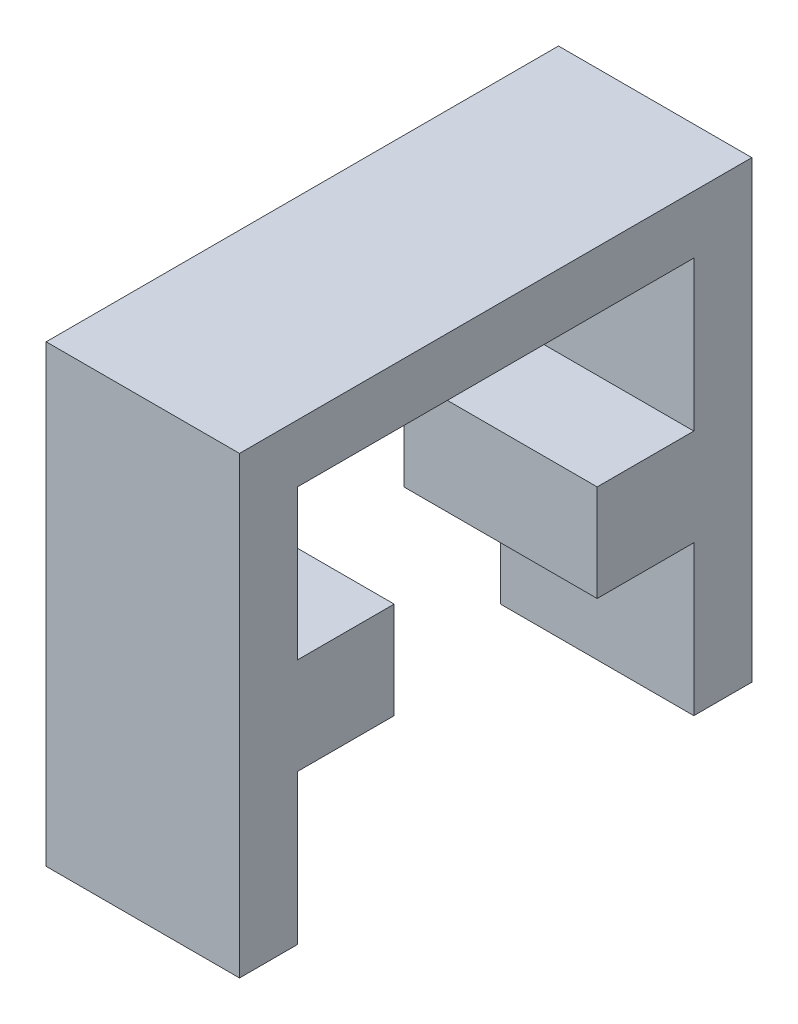
ISO-10303-21;
HEADER;
FILE_DESCRIPTION(('STEP AP214'),'2;1');
FILE_NAME('part.step','',(''),(''),'','','');
FILE_SCHEMA(('AUTOMOTIVE_DESIGN { 1 0 10303 214 1 1 1 1 }'));
ENDSEC;
DATA;
#1=APPLICATION_CONTEXT('core data for automotive mechanical design processes');
#2=APPLICATION_PROTOCOL_DEFINITION('international standard','automotive_design',2000,#1);
#3=PRODUCT_CONTEXT('',#1,'mechanical');
#4=PRODUCT('Part','Part','',(#3));
#5=PRODUCT_RELATED_PRODUCT_CATEGORY('part','',(#4));
#6=PRODUCT_DEFINITION_FORMATION('','',#4);
#7=PRODUCT_DEFINITION_CONTEXT('part definition',#1,'design');
#8=PRODUCT_DEFINITION('design','',#6,#7);
#9=PRODUCT_DEFINITION_SHAPE('','',#8);
#10=(LENGTH_UNIT() NAMED_UNIT(*) SI_UNIT(.MILLI.,.METRE.));
#11=(NAMED_UNIT(*) PLANE_ANGLE_UNIT() SI_UNIT($,.RADIAN.));
#12=(NAMED_UNIT(*) SI_UNIT($,.STERADIAN.) SOLID_ANGLE_UNIT());
#13=UNCERTAINTY_MEASURE_WITH_UNIT(LENGTH_MEASURE(1.E-05),#10,'distance_accuracy_value','');
#14=(GEOMETRIC_REPRESENTATION_CONTEXT(3) GLOBAL_UNCERTAINTY_ASSIGNED_CONTEXT((#13)) GLOBAL_UNIT_ASSIGNED_CONTEXT((#10,
#11,#12)) REPRESENTATION_CONTEXT('',''));
#15=CARTESIAN_POINT('',(0.,0.,0.));
#16=DIRECTION('',(0.,0.,1.));
#17=DIRECTION('',(1.,0.,0.));
#18=AXIS2_PLACEMENT_3D('',#15,#16,#17);
#19=CARTESIAN_POINT('',(10.,0.,0.));
#20=DIRECTION('',(1.,0.,0.));
#21=DIRECTION('',(0.,0.,-1.));
#22=AXIS2_PLACEMENT_3D('',#19,#20,#21);
#23=PLANE('',#22);
#24=DIRECTION('',(0.,1.,0.));
#25=VECTOR('',#24,1.);
#26=CARTESIAN_POINT('',(10.,0.,-26.5));
#27=LINE('',#26,#25);
#28=CARTESIAN_POINT('',(10.,-23.5,-26.5));
#29=VERTEX_POINT('',#28);
#30=CARTESIAN_POINT('',(9.99999999999999,0.,-26.5));
#31=VERTEX_POINT('',#30);
#32=EDGE_CURVE('E172',#29,#31,#27,.T.);
#33=ORIENTED_EDGE('',*,*,#32,.T.);
#34=DIRECTION('',(0.,0.,1.));
#35=VECTOR('',#34,1.);
#36=CARTESIAN_POINT('',(10.,0.,-37.642135623731));
#37=LINE('',#36,#35);
#38=CARTESIAN_POINT('',(10.,0.,0.));
#39=VERTEX_POINT('',#38);
#40=EDGE_CURVE('E169',#31,#39,#37,.T.);
#41=ORIENTED_EDGE('',*,*,#40,.T.);
#42=DIRECTION('',(0.,-1.,0.));
#43=VECTOR('',#42,1.);
#44=CARTESIAN_POINT('',(10.,0.,0.));
#45=LINE('',#44,#43);
#46=CARTESIAN_POINT('',(10.,-23.5,0.));
#47=VERTEX_POINT('',#46);
#48=EDGE_CURVE('E158',#39,#47,#45,.T.);
#49=ORIENTED_EDGE('',*,*,#48,.T.);
#50=DIRECTION('',(0.,0.,-1.));
#51=VECTOR('',#50,1.);
#52=CARTESIAN_POINT('',(10.,-23.5,0.));
#53=LINE('',#52,#51);
#54=CARTESIAN_POINT('',(10.,-23.5,-3.));
#55=VERTEX_POINT('',#54);
#56=EDGE_CURVE('E222',#47,#55,#53,.T.);
#57=ORIENTED_EDGE('',*,*,#56,.T.);
#58=DIRECTION('',(0.,1.,0.));
#59=VECTOR('',#58,1.);
#60=CARTESIAN_POINT('',(10.,-23.5,-3.));
#61=LINE('',#60,#59);
#62=CARTESIAN_POINT('',(10.,-15.75,-3.));
#63=VERTEX_POINT('',#62);
#64=EDGE_CURVE('E225',#55,#63,#61,.T.);
#65=ORIENTED_EDGE('',*,*,#64,.T.);
#66=DIRECTION('',(0.,0.,-1.));
#67=VECTOR('',#66,1.);
#68=CARTESIAN_POINT('',(10.,-15.75,-3.));
#69=LINE('',#68,#67);
#70=CARTESIAN_POINT('',(10.,-15.75,-8.));
#71=VERTEX_POINT('',#70);
#72=EDGE_CURVE('E197',#63,#71,#69,.T.);
#73=ORIENTED_EDGE('',*,*,#72,.T.);
#74=DIRECTION('',(0.,1.,0.));
#75=VECTOR('',#74,1.);
#76=CARTESIAN_POINT('',(10.,-10.75,-8.));
#77=LINE('',#76,#75);
#78=CARTESIAN_POINT('',(10.,-10.75,-8.));
#79=VERTEX_POINT('',#78);
#80=EDGE_CURVE('E206',#71,#79,#77,.T.);
#81=ORIENTED_EDGE('',*,*,#80,.T.);
#82=DIRECTION('',(0.,0.,1.));
#83=VECTOR('',#82,1.);
#84=CARTESIAN_POINT('',(10.,-10.75,-3.));
#85=LINE('',#84,#83);
#86=CARTESIAN_POINT('',(10.,-10.75,-3.00000000000001));
#87=VERTEX_POINT('',#86);
#88=EDGE_CURVE('E55',#79,#87,#85,.T.);
#89=ORIENTED_EDGE('',*,*,#88,.T.);
#90=CARTESIAN_POINT('',(10.,-3.,-3.00000000000001));
#91=VERTEX_POINT('',#90);
#92=EDGE_CURVE('E224',#87,#91,#61,.T.);
#93=ORIENTED_EDGE('',*,*,#92,.T.);
#94=DIRECTION('',(0.,0.,-1.));
#95=VECTOR('',#94,1.);
#96=CARTESIAN_POINT('',(10.,-3.,-3.00000000000001));
#97=LINE('',#96,#95);
#98=CARTESIAN_POINT('',(10.,-3.,-23.5));
#99=VERTEX_POINT('',#98);
#100=EDGE_CURVE('E228',#91,#99,#97,.T.);
#101=ORIENTED_EDGE('',*,*,#100,.T.);
#102=DIRECTION('',(0.,-1.,0.));
#103=VECTOR('',#102,1.);
#104=CARTESIAN_POINT('',(10.,-3.,-23.5));
#105=LINE('',#104,#103);
#106=CARTESIAN_POINT('',(10.,-10.75,-23.5));
#107=VERTEX_POINT('',#106);
#108=EDGE_CURVE('E231',#99,#107,#105,.T.);
#109=ORIENTED_EDGE('',*,*,#108,.T.);
#110=DIRECTION('',(0.,0.,1.));
#111=VECTOR('',#110,1.);
#112=CARTESIAN_POINT('',(10.,-10.75,-23.5));
#113=LINE('',#112,#111);
#114=CARTESIAN_POINT('',(10.,-10.75,-18.5));
#115=VERTEX_POINT('',#114);
#116=EDGE_CURVE('E174',#107,#115,#113,.T.);
#117=ORIENTED_EDGE('',*,*,#116,.T.);
#118=DIRECTION('',(0.,-1.,0.));
#119=VECTOR('',#118,1.);
#120=CARTESIAN_POINT('',(10.,-10.75,-18.5));
#121=LINE('',#120,#119);
#122=CARTESIAN_POINT('',(10.,-15.75,-18.5));
#123=VERTEX_POINT('',#122);
#124=EDGE_CURVE('E185',#115,#123,#121,.T.);
#125=ORIENTED_EDGE('',*,*,#124,.T.);
#126=DIRECTION('',(0.,0.,-1.));
#127=VECTOR('',#126,1.);
#128=CARTESIAN_POINT('',(10.,-15.75,-23.5));
#129=LINE('',#128,#127);
#130=CARTESIAN_POINT('',(10.,-15.75,-23.5));
#131=VERTEX_POINT('',#130);
#132=EDGE_CURVE('E48',#123,#131,#129,.T.);
#133=ORIENTED_EDGE('',*,*,#132,.T.);
#134=CARTESIAN_POINT('',(10.,-23.5,-23.5));
#135=VERTEX_POINT('',#134);
#136=EDGE_CURVE('E230',#131,#135,#105,.T.);
#137=ORIENTED_EDGE('',*,*,#136,.T.);
#138=DIRECTION('',(0.,0.,-1.));
#139=VECTOR('',#138,1.);
#140=CARTESIAN_POINT('',(10.,-23.5,-23.5));
#141=LINE('',#140,#139);
#142=EDGE_CURVE('E234',#135,#29,#141,.T.);
#143=ORIENTED_EDGE('',*,*,#142,.T.);
#144=EDGE_LOOP('',(#33,#41,#49,#57,#65,#73,#81,#89,#93,#101,#109,#117,#125,#133,#137,#143));
#145=FACE_BOUND('',#144,.T.);
#146=ADVANCED_FACE('F33',(#145),#23,.T.);
#147=CARTESIAN_POINT('',(10.,-3.,-23.5));
#148=DIRECTION('',(0.,0.,-1.));
#149=DIRECTION('',(0.,1.,0.));
#150=AXIS2_PLACEMENT_3D('',#147,#148,#149);
#151=PLANE('',#150);
#152=ORIENTED_EDGE('',*,*,#136,.F.);
#153=DIRECTION('',(1.,0.,0.));
#154=VECTOR('',#153,1.);
#155=CARTESIAN_POINT('',(-7.07106781186548,-15.75,-23.5));
#156=LINE('',#155,#154);
#157=CARTESIAN_POINT('',(0.,-15.75,-23.5));
#158=VERTEX_POINT('',#157);
#159=EDGE_CURVE('E180',#158,#131,#156,.T.);
#160=ORIENTED_EDGE('',*,*,#159,.F.);
#161=DIRECTION('',(0.,-1.,0.));
#162=VECTOR('',#161,1.);
#163=CARTESIAN_POINT('',(0.,-3.,-23.5));
#164=LINE('',#163,#162);
#165=CARTESIAN_POINT('',(0.,-23.5,-23.5));
#166=VERTEX_POINT('',#165);
#167=EDGE_CURVE('E246',#158,#166,#164,.T.);
#168=ORIENTED_EDGE('',*,*,#167,.T.);
#169=DIRECTION('',(-1.,0.,0.));
#170=VECTOR('',#169,1.);
#171=CARTESIAN_POINT('',(10.,-23.5,-23.5));
#172=LINE('',#171,#170);
#173=EDGE_CURVE('E252',#135,#166,#172,.T.);
#174=ORIENTED_EDGE('',*,*,#173,.F.);
#175=EDGE_LOOP('',(#152,#160,#168,#174));
#176=FACE_BOUND('',#175,.T.);
#177=ADVANCED_FACE('F286',(#176),#151,.F.);
#178=CARTESIAN_POINT('',(10.,-23.5,-3.));
#179=DIRECTION('',(0.,0.,1.));
#180=DIRECTION('',(0.,-1.,0.));
#181=AXIS2_PLACEMENT_3D('',#178,#179,#180);
#182=PLANE('',#181);
#183=ORIENTED_EDGE('',*,*,#92,.F.);
#184=DIRECTION('',(1.,0.,0.));
#185=VECTOR('',#184,1.);
#186=CARTESIAN_POINT('',(-7.07106781186548,-10.75,-3.));
#187=LINE('',#186,#185);
#188=CARTESIAN_POINT('',(0.,-10.75,-3.));
#189=VERTEX_POINT('',#188);
#190=EDGE_CURVE('E201',#189,#87,#187,.T.);
#191=ORIENTED_EDGE('',*,*,#190,.F.);
#192=DIRECTION('',(0.,1.,0.));
#193=VECTOR('',#192,1.);
#194=CARTESIAN_POINT('',(0.,-23.5,-3.));
#195=LINE('',#194,#193);
#196=CARTESIAN_POINT('',(0.,-3.,-3.00000000000001));
#197=VERTEX_POINT('',#196);
#198=EDGE_CURVE('E240',#189,#197,#195,.T.);
#199=ORIENTED_EDGE('',*,*,#198,.T.);
#200=DIRECTION('',(-1.,0.,0.));
#201=VECTOR('',#200,1.);
#202=CARTESIAN_POINT('',(10.,-3.,-3.00000000000001));
#203=LINE('',#202,#201);
#204=EDGE_CURVE('E258',#91,#197,#203,.T.);
#205=ORIENTED_EDGE('',*,*,#204,.F.);
#206=EDGE_LOOP('',(#183,#191,#199,#205));
#207=FACE_BOUND('',#206,.T.);
#208=ADVANCED_FACE('F283',(#207),#182,.F.);
#209=CARTESIAN_POINT('',(0.,0.,0.));
#210=DIRECTION('',(1.,0.,0.));
#211=DIRECTION('',(0.,0.,-1.));
#212=AXIS2_PLACEMENT_3D('',#209,#210,#211);
#213=PLANE('',#212);
#214=DIRECTION('',(0.,0.,1.));
#215=VECTOR('',#214,1.);
#216=CARTESIAN_POINT('',(0.,0.,-80.));
#217=LINE('',#216,#215);
#218=CARTESIAN_POINT('',(0.,0.,-26.5));
#219=VERTEX_POINT('',#218);
#220=CARTESIAN_POINT('',(0.,0.,0.));
#221=VERTEX_POINT('',#220);
#222=EDGE_CURVE('E162',#219,#221,#217,.T.);
#223=ORIENTED_EDGE('',*,*,#222,.F.);
#224=DIRECTION('',(0.,1.,0.));
#225=VECTOR('',#224,1.);
#226=CARTESIAN_POINT('',(0.,-23.5,-26.5));
#227=LINE('',#226,#225);
#228=CARTESIAN_POINT('',(0.,-23.5,-26.5));
#229=VERTEX_POINT('',#228);
#230=EDGE_CURVE('E147',#229,#219,#227,.T.);
#231=ORIENTED_EDGE('',*,*,#230,.F.);
#232=DIRECTION('',(0.,0.,-1.));
#233=VECTOR('',#232,1.);
#234=CARTESIAN_POINT('',(0.,-23.5,-23.5));
#235=LINE('',#234,#233);
#236=EDGE_CURVE('E159',#166,#229,#235,.T.);
#237=ORIENTED_EDGE('',*,*,#236,.F.);
#238=ORIENTED_EDGE('',*,*,#167,.F.);
#239=DIRECTION('',(0.,0.,1.));
#240=VECTOR('',#239,1.);
#241=CARTESIAN_POINT('',(0.,-15.75,-23.5));
#242=LINE('',#241,#240);
#243=CARTESIAN_POINT('',(0.,-15.75,-18.5));
#244=VERTEX_POINT('',#243);
#245=EDGE_CURVE('E179',#158,#244,#242,.T.);
#246=ORIENTED_EDGE('',*,*,#245,.T.);
#247=DIRECTION('',(0.,1.,0.));
#248=VECTOR('',#247,1.);
#249=CARTESIAN_POINT('',(0.,-10.75,-18.5));
#250=LINE('',#249,#248);
#251=CARTESIAN_POINT('',(0.,-10.75,-18.5));
#252=VERTEX_POINT('',#251);
#253=EDGE_CURVE('E177',#244,#252,#250,.T.);
#254=ORIENTED_EDGE('',*,*,#253,.T.);
#255=DIRECTION('',(0.,0.,-1.));
#256=VECTOR('',#255,1.);
#257=CARTESIAN_POINT('',(0.,-10.75,-23.5));
#258=LINE('',#257,#256);
#259=CARTESIAN_POINT('',(0.,-10.75,-23.5));
#260=VERTEX_POINT('',#259);
#261=EDGE_CURVE('E182',#252,#260,#258,.T.);
#262=ORIENTED_EDGE('',*,*,#261,.T.);
#263=CARTESIAN_POINT('',(0.,-3.,-23.5));
#264=VERTEX_POINT('',#263);
#265=EDGE_CURVE('E247',#264,#260,#164,.T.);
#266=ORIENTED_EDGE('',*,*,#265,.F.);
#267=DIRECTION('',(0.,0.,-1.));
#268=VECTOR('',#267,1.);
#269=CARTESIAN_POINT('',(0.,-3.,-3.00000000000001));
#270=LINE('',#269,#268);
#271=EDGE_CURVE('E244',#197,#264,#270,.T.);
#272=ORIENTED_EDGE('',*,*,#271,.F.);
#273=ORIENTED_EDGE('',*,*,#198,.F.);
#274=DIRECTION('',(0.,0.,-1.));
#275=VECTOR('',#274,1.);
#276=CARTESIAN_POINT('',(0.,-10.75,-3.));
#277=LINE('',#276,#275);
#278=CARTESIAN_POINT('',(0.,-10.75,-8.));
#279=VERTEX_POINT('',#278);
#280=EDGE_CURVE('E200',#189,#279,#277,.T.);
#281=ORIENTED_EDGE('',*,*,#280,.T.);
#282=DIRECTION('',(0.,-1.,0.));
#283=VECTOR('',#282,1.);
#284=CARTESIAN_POINT('',(0.,-10.75,-8.));
#285=LINE('',#284,#283);
#286=CARTESIAN_POINT('',(0.,-15.75,-8.));
#287=VERTEX_POINT('',#286);
#288=EDGE_CURVE('E198',#279,#287,#285,.T.);
#289=ORIENTED_EDGE('',*,*,#288,.T.);
#290=DIRECTION('',(0.,0.,1.));
#291=VECTOR('',#290,1.);
#292=CARTESIAN_POINT('',(0.,-15.75,-3.));
#293=LINE('',#292,#291);
#294=CARTESIAN_POINT('',(0.,-15.75,-3.));
#295=VERTEX_POINT('',#294);
#296=EDGE_CURVE('E203',#287,#295,#293,.T.);
#297=ORIENTED_EDGE('',*,*,#296,.T.);
#298=CARTESIAN_POINT('',(0.,-23.5,-3.));
#299=VERTEX_POINT('',#298);
#300=EDGE_CURVE('E241',#299,#295,#195,.T.);
#301=ORIENTED_EDGE('',*,*,#300,.F.);
#302=DIRECTION('',(0.,0.,-1.));
#303=VECTOR('',#302,1.);
#304=CARTESIAN_POINT('',(0.,-23.5,0.));
#305=LINE('',#304,#303);
#306=CARTESIAN_POINT('',(0.,-23.5,0.));
#307=VERTEX_POINT('',#306);
#308=EDGE_CURVE('E238',#307,#299,#305,.T.);
#309=ORIENTED_EDGE('',*,*,#308,.F.);
#310=DIRECTION('',(0.,-1.,0.));
#311=VECTOR('',#310,1.);
#312=CARTESIAN_POINT('',(0.,0.,0.));
#313=LINE('',#312,#311);
#314=EDGE_CURVE('E165',#221,#307,#313,.T.);
#315=ORIENTED_EDGE('',*,*,#314,.F.);
#316=EDGE_LOOP('',(#223,#231,#237,#238,#246,#254,#262,#266,#272,#273,#281,#289,#297,#301,#309,#315));
#317=FACE_BOUND('',#316,.T.);
#318=ADVANCED_FACE('F163',(#317),#213,.F.);
#319=CARTESIAN_POINT('',(10.,0.,0.));
#320=DIRECTION('',(0.,0.,-1.));
#321=DIRECTION('',(0.,1.,0.));
#322=AXIS2_PLACEMENT_3D('',#319,#320,#321);
#323=PLANE('',#322);
#324=ORIENTED_EDGE('',*,*,#48,.F.);
#325=DIRECTION('',(1.,0.,0.));
#326=VECTOR('',#325,1.);
#327=CARTESIAN_POINT('',(0.,0.,0.));
#328=LINE('',#327,#326);
#329=EDGE_CURVE('E218',#221,#39,#328,.T.);
#330=ORIENTED_EDGE('',*,*,#329,.F.);
#331=ORIENTED_EDGE('',*,*,#314,.T.);
#332=DIRECTION('',(-1.,0.,0.));
#333=VECTOR('',#332,1.);
#334=CARTESIAN_POINT('',(10.,-23.5,0.));
#335=LINE('',#334,#333);
#336=EDGE_CURVE('E11',#47,#307,#335,.T.);
#337=ORIENTED_EDGE('',*,*,#336,.F.);
#338=EDGE_LOOP('',(#324,#330,#331,#337));
#339=FACE_BOUND('',#338,.T.);
#340=ADVANCED_FACE('F35',(#339),#323,.F.);
#341=CARTESIAN_POINT('',(10.,-23.5,0.));
#342=DIRECTION('',(0.,1.,0.));
#343=DIRECTION('',(0.,0.,1.));
#344=AXIS2_PLACEMENT_3D('',#341,#342,#343);
#345=PLANE('',#344);
#346=ORIENTED_EDGE('',*,*,#308,.T.);
#347=DIRECTION('',(-1.,0.,0.));
#348=VECTOR('',#347,1.);
#349=CARTESIAN_POINT('',(10.,-23.5,-3.));
#350=LINE('',#349,#348);
#351=EDGE_CURVE('E41',#55,#299,#350,.T.);
#352=ORIENTED_EDGE('',*,*,#351,.F.);
#353=ORIENTED_EDGE('',*,*,#56,.F.);
#354=ORIENTED_EDGE('',*,*,#336,.T.);
#355=EDGE_LOOP('',(#346,#352,#353,#354));
#356=FACE_BOUND('',#355,.T.);
#357=ADVANCED_FACE('F276',(#356),#345,.F.);
#358=ORIENTED_EDGE('',*,*,#300,.T.);
#359=DIRECTION('',(1.,0.,0.));
#360=VECTOR('',#359,1.);
#361=CARTESIAN_POINT('',(-7.07106781186548,-15.75,-3.));
#362=LINE('',#361,#360);
#363=EDGE_CURVE('E209',#295,#63,#362,.T.);
#364=ORIENTED_EDGE('',*,*,#363,.T.);
#365=ORIENTED_EDGE('',*,*,#64,.F.);
#366=ORIENTED_EDGE('',*,*,#351,.T.);
#367=EDGE_LOOP('',(#358,#364,#365,#366));
#368=FACE_BOUND('',#367,.T.);
#369=ADVANCED_FACE('F265',(#368),#182,.F.);
#370=CARTESIAN_POINT('',(10.,-3.,-3.00000000000001));
#371=DIRECTION('',(0.,1.,0.));
#372=DIRECTION('',(0.,0.,1.));
#373=AXIS2_PLACEMENT_3D('',#370,#371,#372);
#374=PLANE('',#373);
#375=ORIENTED_EDGE('',*,*,#271,.T.);
#376=DIRECTION('',(-1.,0.,0.));
#377=VECTOR('',#376,1.);
#378=CARTESIAN_POINT('',(10.,-3.,-23.5));
#379=LINE('',#378,#377);
#380=EDGE_CURVE('E255',#99,#264,#379,.T.);
#381=ORIENTED_EDGE('',*,*,#380,.F.);
#382=ORIENTED_EDGE('',*,*,#100,.F.);
#383=ORIENTED_EDGE('',*,*,#204,.T.);
#384=EDGE_LOOP('',(#375,#381,#382,#383));
#385=FACE_BOUND('',#384,.T.);
#386=ADVANCED_FACE('F304',(#385),#374,.F.);
#387=ORIENTED_EDGE('',*,*,#265,.T.);
#388=DIRECTION('',(1.,0.,0.));
#389=VECTOR('',#388,1.);
#390=CARTESIAN_POINT('',(-7.07106781186548,-10.75,-23.5));
#391=LINE('',#390,#389);
#392=EDGE_CURVE('E188',#260,#107,#391,.T.);
#393=ORIENTED_EDGE('',*,*,#392,.T.);
#394=ORIENTED_EDGE('',*,*,#108,.F.);
#395=ORIENTED_EDGE('',*,*,#380,.T.);
#396=EDGE_LOOP('',(#387,#393,#394,#395));
#397=FACE_BOUND('',#396,.T.);
#398=ADVANCED_FACE('F293',(#397),#151,.F.);
#399=CARTESIAN_POINT('',(10.,-23.5,-23.5));
#400=DIRECTION('',(0.,1.,0.));
#401=DIRECTION('',(0.,0.,1.));
#402=AXIS2_PLACEMENT_3D('',#399,#400,#401);
#403=PLANE('',#402);
#404=ORIENTED_EDGE('',*,*,#236,.T.);
#405=DIRECTION('',(-1.,0.,0.));
#406=VECTOR('',#405,1.);
#407=CARTESIAN_POINT('',(10.,-23.5,-26.5));
#408=LINE('',#407,#406);
#409=EDGE_CURVE('E154',#29,#229,#408,.T.);
#410=ORIENTED_EDGE('',*,*,#409,.F.);
#411=ORIENTED_EDGE('',*,*,#142,.F.);
#412=ORIENTED_EDGE('',*,*,#173,.T.);
#413=EDGE_LOOP('',(#404,#410,#411,#412));
#414=FACE_BOUND('',#413,.T.);
#415=ADVANCED_FACE('F299',(#414),#403,.F.);
#416=CARTESIAN_POINT('',(10.,-23.5,-26.5));
#417=DIRECTION('',(0.,0.,1.));
#418=DIRECTION('',(1.,0.,0.));
#419=AXIS2_PLACEMENT_3D('',#416,#417,#418);
#420=PLANE('',#419);
#421=ORIENTED_EDGE('',*,*,#230,.T.);
#422=DIRECTION('',(-1.,0.,0.));
#423=VECTOR('',#422,1.);
#424=CARTESIAN_POINT('',(129.040296142579,0.,-26.5));
#425=LINE('',#424,#423);
#426=EDGE_CURVE('E151',#31,#219,#425,.T.);
#427=ORIENTED_EDGE('',*,*,#426,.F.);
#428=ORIENTED_EDGE('',*,*,#32,.F.);
#429=ORIENTED_EDGE('',*,*,#409,.T.);
#430=EDGE_LOOP('',(#421,#427,#428,#429));
#431=FACE_BOUND('',#430,.T.);
#432=ADVANCED_FACE('F149',(#431),#420,.F.);
#433=CARTESIAN_POINT('',(0.,0.,-37.642135623731));
#434=DIRECTION('',(0.,-1.,0.));
#435=DIRECTION('',(0.,0.,-1.));
#436=AXIS2_PLACEMENT_3D('',#433,#434,#435);
#437=PLANE('',#436);
#438=ORIENTED_EDGE('',*,*,#426,.T.);
#439=ORIENTED_EDGE('',*,*,#222,.T.);
#440=ORIENTED_EDGE('',*,*,#329,.T.);
#441=ORIENTED_EDGE('',*,*,#40,.F.);
#442=EDGE_LOOP('',(#438,#439,#440,#441));
#443=FACE_BOUND('',#442,.T.);
#444=ADVANCED_FACE('F171',(#443),#437,.F.);
#445=CARTESIAN_POINT('',(-7.07106781186548,-10.75,-3.));
#446=DIRECTION('',(0.,1.,0.));
#447=DIRECTION('',(0.,0.,1.));
#448=AXIS2_PLACEMENT_3D('',#445,#446,#447);
#449=PLANE('',#448);
#450=ORIENTED_EDGE('',*,*,#280,.F.);
#451=ORIENTED_EDGE('',*,*,#190,.T.);
#452=ORIENTED_EDGE('',*,*,#88,.F.);
#453=DIRECTION('',(1.,0.,0.));
#454=VECTOR('',#453,1.);
#455=CARTESIAN_POINT('',(-7.07106781186548,-10.75,-8.));
#456=LINE('',#455,#454);
#457=EDGE_CURVE('E211',#279,#79,#456,.T.);
#458=ORIENTED_EDGE('',*,*,#457,.F.);
#459=EDGE_LOOP('',(#450,#451,#452,#458));
#460=FACE_BOUND('',#459,.T.);
#461=ADVANCED_FACE('F351',(#460),#449,.T.);
#462=CARTESIAN_POINT('',(-7.07106781186548,-10.75,-8.));
#463=DIRECTION('',(0.,0.,-1.));
#464=DIRECTION('',(0.,1.,0.));
#465=AXIS2_PLACEMENT_3D('',#462,#463,#464);
#466=PLANE('',#465);
#467=ORIENTED_EDGE('',*,*,#288,.F.);
#468=ORIENTED_EDGE('',*,*,#457,.T.);
#469=ORIENTED_EDGE('',*,*,#80,.F.);
#470=DIRECTION('',(1.,0.,0.));
#471=VECTOR('',#470,1.);
#472=CARTESIAN_POINT('',(-7.07106781186548,-15.75,-8.));
#473=LINE('',#472,#471);
#474=EDGE_CURVE('E213',#287,#71,#473,.T.);
#475=ORIENTED_EDGE('',*,*,#474,.F.);
#476=EDGE_LOOP('',(#467,#468,#469,#475));
#477=FACE_BOUND('',#476,.T.);
#478=ADVANCED_FACE('F354',(#477),#466,.T.);
#479=CARTESIAN_POINT('',(-7.07106781186548,-15.75,-3.));
#480=DIRECTION('',(0.,-1.,0.));
#481=DIRECTION('',(0.,0.,-1.));
#482=AXIS2_PLACEMENT_3D('',#479,#480,#481);
#483=PLANE('',#482);
#484=ORIENTED_EDGE('',*,*,#296,.F.);
#485=ORIENTED_EDGE('',*,*,#474,.T.);
#486=ORIENTED_EDGE('',*,*,#72,.F.);
#487=ORIENTED_EDGE('',*,*,#363,.F.);
#488=EDGE_LOOP('',(#484,#485,#486,#487));
#489=FACE_BOUND('',#488,.T.);
#490=ADVANCED_FACE('F273',(#489),#483,.T.);
#491=CARTESIAN_POINT('',(-7.07106781186548,-15.75,-23.5));
#492=DIRECTION('',(0.,-1.,0.));
#493=DIRECTION('',(0.,0.,-1.));
#494=AXIS2_PLACEMENT_3D('',#491,#492,#493);
#495=PLANE('',#494);
#496=ORIENTED_EDGE('',*,*,#245,.F.);
#497=ORIENTED_EDGE('',*,*,#159,.T.);
#498=ORIENTED_EDGE('',*,*,#132,.F.);
#499=DIRECTION('',(1.,0.,0.));
#500=VECTOR('',#499,1.);
#501=CARTESIAN_POINT('',(-7.07106781186548,-15.75,-18.5));
#502=LINE('',#501,#500);
#503=EDGE_CURVE('E190',#244,#123,#502,.T.);
#504=ORIENTED_EDGE('',*,*,#503,.F.);
#505=EDGE_LOOP('',(#496,#497,#498,#504));
#506=FACE_BOUND('',#505,.T.);
#507=ADVANCED_FACE('F334',(#506),#495,.T.);
#508=CARTESIAN_POINT('',(-7.07106781186548,-10.75,-18.5));
#509=DIRECTION('',(0.,0.,1.));
#510=DIRECTION('',(1.,0.,0.));
#511=AXIS2_PLACEMENT_3D('',#508,#509,#510);
#512=PLANE('',#511);
#513=ORIENTED_EDGE('',*,*,#253,.F.);
#514=ORIENTED_EDGE('',*,*,#503,.T.);
#515=ORIENTED_EDGE('',*,*,#124,.F.);
#516=DIRECTION('',(1.,0.,0.));
#517=VECTOR('',#516,1.);
#518=CARTESIAN_POINT('',(-7.07106781186548,-10.75,-18.5));
#519=LINE('',#518,#517);
#520=EDGE_CURVE('E192',#252,#115,#519,.T.);
#521=ORIENTED_EDGE('',*,*,#520,.F.);
#522=EDGE_LOOP('',(#513,#514,#515,#521));
#523=FACE_BOUND('',#522,.T.);
#524=ADVANCED_FACE('F341',(#523),#512,.T.);
#525=CARTESIAN_POINT('',(-7.07106781186548,-10.75,-23.5));
#526=DIRECTION('',(0.,1.,0.));
#527=DIRECTION('',(0.,0.,1.));
#528=AXIS2_PLACEMENT_3D('',#525,#526,#527);
#529=PLANE('',#528);
#530=ORIENTED_EDGE('',*,*,#261,.F.);
#531=ORIENTED_EDGE('',*,*,#520,.T.);
#532=ORIENTED_EDGE('',*,*,#116,.F.);
#533=ORIENTED_EDGE('',*,*,#392,.F.);
#534=EDGE_LOOP('',(#530,#531,#532,#533));
#535=FACE_BOUND('',#534,.T.);
#536=ADVANCED_FACE('F328',(#535),#529,.T.);
#537=CLOSED_SHELL('',(#146,#177,#208,#318,#340,#357,#369,#386,#398,#415,#432,#444,#461,#478,
#490,#507,#524,#536));
#538=MANIFOLD_SOLID_BREP('B2',#537);
#539=ADVANCED_BREP_SHAPE_REPRESENTATION('',(#18,#538),#14);
#540=SHAPE_DEFINITION_REPRESENTATION(#9,#539);
ENDSEC;
END-ISO-10303-21;
